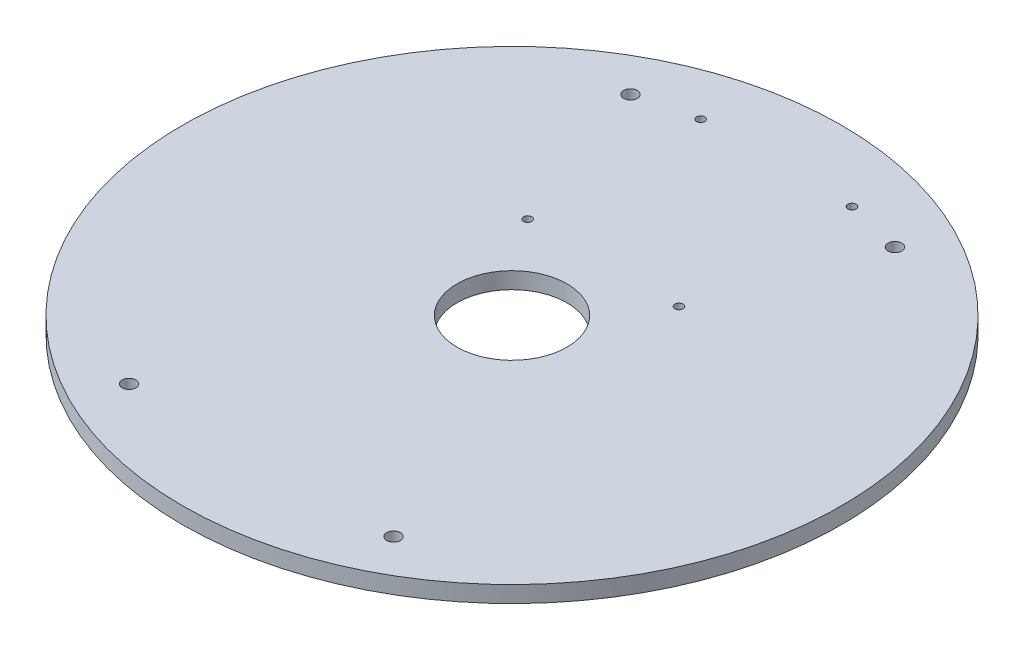
ISO-10303-21;
HEADER;
FILE_DESCRIPTION(('STEP AP214'),'2;1');
FILE_NAME('part.step','',(''),(''),'','','');
FILE_SCHEMA(('AUTOMOTIVE_DESIGN { 1 0 10303 214 1 1 1 1 }'));
ENDSEC;
DATA;
#1=APPLICATION_CONTEXT('core data for automotive mechanical design processes');
#2=APPLICATION_PROTOCOL_DEFINITION('international standard','automotive_design',2000,#1);
#3=PRODUCT_CONTEXT('',#1,'mechanical');
#4=PRODUCT('Part','Part','',(#3));
#5=PRODUCT_RELATED_PRODUCT_CATEGORY('part','',(#4));
#6=PRODUCT_DEFINITION_FORMATION('','',#4);
#7=PRODUCT_DEFINITION_CONTEXT('part definition',#1,'design');
#8=PRODUCT_DEFINITION('design','',#6,#7);
#9=PRODUCT_DEFINITION_SHAPE('','',#8);
#10=(LENGTH_UNIT() NAMED_UNIT(*) SI_UNIT(.MILLI.,.METRE.));
#11=(NAMED_UNIT(*) PLANE_ANGLE_UNIT() SI_UNIT($,.RADIAN.));
#12=(NAMED_UNIT(*) SI_UNIT($,.STERADIAN.) SOLID_ANGLE_UNIT());
#13=UNCERTAINTY_MEASURE_WITH_UNIT(LENGTH_MEASURE(1.E-05),#10,'distance_accuracy_value','');
#14=(GEOMETRIC_REPRESENTATION_CONTEXT(3) GLOBAL_UNCERTAINTY_ASSIGNED_CONTEXT((#13)) GLOBAL_UNIT_ASSIGNED_CONTEXT((#10,
#11,#12)) REPRESENTATION_CONTEXT('',''));
#15=CARTESIAN_POINT('',(0.,0.,0.));
#16=DIRECTION('',(0.,0.,1.));
#17=DIRECTION('',(1.,0.,0.));
#18=AXIS2_PLACEMENT_3D('',#15,#16,#17);
#19=CARTESIAN_POINT('',(0.,3.,0.));
#20=DIRECTION('',(0.,-1.,0.));
#21=DIRECTION('',(0.,0.,-1.));
#22=AXIS2_PLACEMENT_3D('',#19,#20,#21);
#23=CYLINDRICAL_SURFACE('',#22,60.);
#24=CARTESIAN_POINT('',(0.,3.,0.));
#25=DIRECTION('',(0.,1.,0.));
#26=DIRECTION('',(0.,0.,1.));
#27=AXIS2_PLACEMENT_3D('',#24,#25,#26);
#28=CIRCLE('',#27,60.);
#29=CARTESIAN_POINT('',(0.,3.,60.));
#30=VERTEX_POINT('',#29);
#31=EDGE_CURVE('E10',#30,#30,#28,.T.);
#32=ORIENTED_EDGE('',*,*,#31,.F.);
#33=EDGE_LOOP('',(#32));
#34=FACE_BOUND('',#33,.T.);
#35=CARTESIAN_POINT('',(0.,0.,0.));
#36=DIRECTION('',(0.,1.,0.));
#37=DIRECTION('',(0.,0.,1.));
#38=AXIS2_PLACEMENT_3D('',#35,#36,#37);
#39=CIRCLE('',#38,60.);
#40=CARTESIAN_POINT('',(0.,0.,60.));
#41=VERTEX_POINT('',#40);
#42=EDGE_CURVE('E34',#41,#41,#39,.T.);
#43=ORIENTED_EDGE('',*,*,#42,.T.);
#44=EDGE_LOOP('',(#43));
#45=FACE_BOUND('',#44,.T.);
#46=ADVANCED_FACE('F31',(#34,#45),#23,.T.);
#47=CARTESIAN_POINT('',(0.,3.,0.));
#48=DIRECTION('',(0.,1.,0.));
#49=DIRECTION('',(0.,0.,1.));
#50=AXIS2_PLACEMENT_3D('',#47,#48,#49);
#51=PLANE('',#50);
#52=CARTESIAN_POINT('',(-13.7737140560646,3.,-48.120776319641));
#53=DIRECTION('',(0.,1.,0.));
#54=DIRECTION('',(0.,0.,-1.));
#55=AXIS2_PLACEMENT_3D('',#52,#53,#54);
#56=CIRCLE('',#55,0.75);
#57=CARTESIAN_POINT('',(-13.7737140560646,3.,-48.870776319641));
#58=VERTEX_POINT('',#57);
#59=EDGE_CURVE('E79',#58,#58,#56,.T.);
#60=ORIENTED_EDGE('',*,*,#59,.F.);
#61=EDGE_LOOP('',(#60));
#62=FACE_BOUND('',#61,.T.);
#63=CARTESIAN_POINT('',(-13.7737140560646,3.,-16.620776319641));
#64=DIRECTION('',(0.,1.,0.));
#65=DIRECTION('',(0.,0.,1.));
#66=AXIS2_PLACEMENT_3D('',#63,#64,#65);
#67=CIRCLE('',#66,0.75);
#68=CARTESIAN_POINT('',(-13.7737140560646,3.,-15.870776319641));
#69=VERTEX_POINT('',#68);
#70=EDGE_CURVE('E85',#69,#69,#67,.T.);
#71=ORIENTED_EDGE('',*,*,#70,.F.);
#72=EDGE_LOOP('',(#71));
#73=FACE_BOUND('',#72,.T.);
#74=CARTESIAN_POINT('',(13.7737140560646,3.,-16.620776319641));
#75=DIRECTION('',(0.,1.,0.));
#76=DIRECTION('',(0.,0.,-1.));
#77=AXIS2_PLACEMENT_3D('',#74,#75,#76);
#78=CIRCLE('',#77,0.75);
#79=CARTESIAN_POINT('',(13.7737140560646,3.,-17.370776319641));
#80=VERTEX_POINT('',#79);
#81=EDGE_CURVE('E91',#80,#80,#78,.T.);
#82=ORIENTED_EDGE('',*,*,#81,.F.);
#83=EDGE_LOOP('',(#82));
#84=FACE_BOUND('',#83,.T.);
#85=CARTESIAN_POINT('',(13.7737140560646,3.,-48.120776319641));
#86=DIRECTION('',(0.,1.,0.));
#87=DIRECTION('',(0.,0.,1.));
#88=AXIS2_PLACEMENT_3D('',#85,#86,#87);
#89=CIRCLE('',#88,0.75);
#90=CARTESIAN_POINT('',(13.7737140560646,3.,-47.370776319641));
#91=VERTEX_POINT('',#90);
#92=EDGE_CURVE('E73',#91,#91,#89,.T.);
#93=ORIENTED_EDGE('',*,*,#92,.F.);
#94=EDGE_LOOP('',(#93));
#95=FACE_BOUND('',#94,.T.);
#96=CARTESIAN_POINT('',(0.,3.,0.));
#97=DIRECTION('',(0.,1.,0.));
#98=DIRECTION('',(0.,0.,1.));
#99=AXIS2_PLACEMENT_3D('',#96,#97,#98);
#100=CIRCLE('',#99,10.);
#101=CARTESIAN_POINT('',(0.,3.,10.));
#102=VERTEX_POINT('',#101);
#103=EDGE_CURVE('E67',#102,#102,#100,.T.);
#104=ORIENTED_EDGE('',*,*,#103,.F.);
#105=EDGE_LOOP('',(#104));
#106=FACE_BOUND('',#105,.T.);
#107=CARTESIAN_POINT('',(-24.0731025072115,3.,45.6446312019142));
#108=DIRECTION('',(0.,1.,0.));
#109=DIRECTION('',(0.,0.,-1.));
#110=AXIS2_PLACEMENT_3D('',#107,#108,#109);
#111=CIRCLE('',#110,1.25);
#112=CARTESIAN_POINT('',(-24.0731025072115,3.,44.3946312019142));
#113=VERTEX_POINT('',#112);
#114=EDGE_CURVE('E49',#113,#113,#111,.T.);
#115=ORIENTED_EDGE('',*,*,#114,.F.);
#116=EDGE_LOOP('',(#115));
#117=FACE_BOUND('',#116,.T.);
#118=CARTESIAN_POINT('',(24.0731025072115,3.,45.6446312019142));
#119=DIRECTION('',(0.,1.,0.));
#120=DIRECTION('',(0.,0.,1.));
#121=AXIS2_PLACEMENT_3D('',#118,#119,#120);
#122=CIRCLE('',#121,1.25);
#123=CARTESIAN_POINT('',(24.0731025072115,3.,46.8946312019142));
#124=VERTEX_POINT('',#123);
#125=EDGE_CURVE('E56',#124,#124,#122,.T.);
#126=ORIENTED_EDGE('',*,*,#125,.F.);
#127=EDGE_LOOP('',(#126));
#128=FACE_BOUND('',#127,.T.);
#129=CARTESIAN_POINT('',(24.0731025072115,3.,-45.6446312019142));
#130=DIRECTION('',(0.,1.,0.));
#131=DIRECTION('',(0.,0.,-1.));
#132=AXIS2_PLACEMENT_3D('',#129,#130,#131);
#133=CIRCLE('',#132,1.25);
#134=CARTESIAN_POINT('',(24.0731025072115,3.,-46.8946312019142));
#135=VERTEX_POINT('',#134);
#136=EDGE_CURVE('E62',#135,#135,#133,.T.);
#137=ORIENTED_EDGE('',*,*,#136,.F.);
#138=EDGE_LOOP('',(#137));
#139=FACE_BOUND('',#138,.T.);
#140=CARTESIAN_POINT('',(-24.0731025072115,3.,-45.6446312019142));
#141=DIRECTION('',(0.,1.,0.));
#142=DIRECTION('',(0.,0.,1.));
#143=AXIS2_PLACEMENT_3D('',#140,#141,#142);
#144=CIRCLE('',#143,1.25);
#145=CARTESIAN_POINT('',(-24.0731025072115,3.,-44.3946312019142));
#146=VERTEX_POINT('',#145);
#147=EDGE_CURVE('E43',#146,#146,#144,.T.);
#148=ORIENTED_EDGE('',*,*,#147,.F.);
#149=EDGE_LOOP('',(#148));
#150=FACE_BOUND('',#149,.T.);
#151=ORIENTED_EDGE('',*,*,#31,.T.);
#152=EDGE_LOOP('',(#151));
#153=FACE_BOUND('',#152,.T.);
#154=ADVANCED_FACE('F108',(#62,#73,#84,#95,#106,#117,#128,#139,#150,#153),#51,.T.);
#155=CARTESIAN_POINT('',(0.,0.,0.));
#156=DIRECTION('',(0.,1.,0.));
#157=DIRECTION('',(0.,0.,1.));
#158=AXIS2_PLACEMENT_3D('',#155,#156,#157);
#159=PLANE('',#158);
#160=CARTESIAN_POINT('',(-13.7737140560646,0.,-48.120776319641));
#161=DIRECTION('',(0.,1.,0.));
#162=DIRECTION('',(0.,0.,-1.));
#163=AXIS2_PLACEMENT_3D('',#160,#161,#162);
#164=CIRCLE('',#163,0.75);
#165=CARTESIAN_POINT('',(-13.7737140560646,0.,-48.870776319641));
#166=VERTEX_POINT('',#165);
#167=EDGE_CURVE('E82',#166,#166,#164,.T.);
#168=ORIENTED_EDGE('',*,*,#167,.T.);
#169=EDGE_LOOP('',(#168));
#170=FACE_BOUND('',#169,.T.);
#171=CARTESIAN_POINT('',(-13.7737140560646,0.,-16.620776319641));
#172=DIRECTION('',(0.,1.,0.));
#173=DIRECTION('',(0.,0.,1.));
#174=AXIS2_PLACEMENT_3D('',#171,#172,#173);
#175=CIRCLE('',#174,0.75);
#176=CARTESIAN_POINT('',(-13.7737140560646,0.,-15.870776319641));
#177=VERTEX_POINT('',#176);
#178=EDGE_CURVE('E88',#177,#177,#175,.T.);
#179=ORIENTED_EDGE('',*,*,#178,.T.);
#180=EDGE_LOOP('',(#179));
#181=FACE_BOUND('',#180,.T.);
#182=CARTESIAN_POINT('',(13.7737140560646,0.,-16.620776319641));
#183=DIRECTION('',(0.,1.,0.));
#184=DIRECTION('',(0.,0.,-1.));
#185=AXIS2_PLACEMENT_3D('',#182,#183,#184);
#186=CIRCLE('',#185,0.75);
#187=CARTESIAN_POINT('',(13.7737140560646,0.,-17.370776319641));
#188=VERTEX_POINT('',#187);
#189=EDGE_CURVE('E76',#188,#188,#186,.T.);
#190=ORIENTED_EDGE('',*,*,#189,.T.);
#191=EDGE_LOOP('',(#190));
#192=FACE_BOUND('',#191,.T.);
#193=CARTESIAN_POINT('',(13.7737140560646,0.,-48.120776319641));
#194=DIRECTION('',(0.,1.,0.));
#195=DIRECTION('',(0.,0.,1.));
#196=AXIS2_PLACEMENT_3D('',#193,#194,#195);
#197=CIRCLE('',#196,0.75);
#198=CARTESIAN_POINT('',(13.7737140560646,0.,-47.370776319641));
#199=VERTEX_POINT('',#198);
#200=EDGE_CURVE('E70',#199,#199,#197,.T.);
#201=ORIENTED_EDGE('',*,*,#200,.T.);
#202=EDGE_LOOP('',(#201));
#203=FACE_BOUND('',#202,.T.);
#204=CARTESIAN_POINT('',(0.,0.,0.));
#205=DIRECTION('',(0.,1.,0.));
#206=DIRECTION('',(0.,0.,1.));
#207=AXIS2_PLACEMENT_3D('',#204,#205,#206);
#208=CIRCLE('',#207,10.);
#209=CARTESIAN_POINT('',(0.,0.,10.));
#210=VERTEX_POINT('',#209);
#211=EDGE_CURVE('E53',#210,#210,#208,.T.);
#212=ORIENTED_EDGE('',*,*,#211,.T.);
#213=EDGE_LOOP('',(#212));
#214=FACE_BOUND('',#213,.T.);
#215=CARTESIAN_POINT('',(-24.0731025072115,0.,45.6446312019142));
#216=DIRECTION('',(0.,1.,0.));
#217=DIRECTION('',(0.,0.,-1.));
#218=AXIS2_PLACEMENT_3D('',#215,#216,#217);
#219=CIRCLE('',#218,1.25);
#220=CARTESIAN_POINT('',(-24.0731025072115,0.,44.3946312019142));
#221=VERTEX_POINT('',#220);
#222=EDGE_CURVE('E52',#221,#221,#219,.T.);
#223=ORIENTED_EDGE('',*,*,#222,.T.);
#224=EDGE_LOOP('',(#223));
#225=FACE_BOUND('',#224,.T.);
#226=CARTESIAN_POINT('',(24.0731025072115,0.,45.6446312019142));
#227=DIRECTION('',(0.,1.,0.));
#228=DIRECTION('',(0.,0.,1.));
#229=AXIS2_PLACEMENT_3D('',#226,#227,#228);
#230=CIRCLE('',#229,1.25);
#231=CARTESIAN_POINT('',(24.0731025072115,0.,46.8946312019142));
#232=VERTEX_POINT('',#231);
#233=EDGE_CURVE('E59',#232,#232,#230,.T.);
#234=ORIENTED_EDGE('',*,*,#233,.T.);
#235=EDGE_LOOP('',(#234));
#236=FACE_BOUND('',#235,.T.);
#237=CARTESIAN_POINT('',(24.0731025072115,0.,-45.6446312019142));
#238=DIRECTION('',(0.,1.,0.));
#239=DIRECTION('',(0.,0.,-1.));
#240=AXIS2_PLACEMENT_3D('',#237,#238,#239);
#241=CIRCLE('',#240,1.25);
#242=CARTESIAN_POINT('',(24.0731025072115,0.,-46.8946312019142));
#243=VERTEX_POINT('',#242);
#244=EDGE_CURVE('E46',#243,#243,#241,.T.);
#245=ORIENTED_EDGE('',*,*,#244,.T.);
#246=EDGE_LOOP('',(#245));
#247=FACE_BOUND('',#246,.T.);
#248=CARTESIAN_POINT('',(-24.0731025072115,0.,-45.6446312019142));
#249=DIRECTION('',(0.,1.,0.));
#250=DIRECTION('',(0.,0.,1.));
#251=AXIS2_PLACEMENT_3D('',#248,#249,#250);
#252=CIRCLE('',#251,1.25);
#253=CARTESIAN_POINT('',(-24.0731025072115,0.,-44.3946312019142));
#254=VERTEX_POINT('',#253);
#255=EDGE_CURVE('E41',#254,#254,#252,.T.);
#256=ORIENTED_EDGE('',*,*,#255,.T.);
#257=EDGE_LOOP('',(#256));
#258=FACE_BOUND('',#257,.T.);
#259=ORIENTED_EDGE('',*,*,#42,.F.);
#260=EDGE_LOOP('',(#259));
#261=FACE_BOUND('',#260,.T.);
#262=ADVANCED_FACE('F97',(#170,#181,#192,#203,#214,#225,#236,#247,#258,#261),#159,.F.);
#263=CARTESIAN_POINT('',(-24.0731025072115,0.,-45.6446312019142));
#264=DIRECTION('',(0.,1.,0.));
#265=DIRECTION('',(0.,0.,1.));
#266=AXIS2_PLACEMENT_3D('',#263,#264,#265);
#267=CYLINDRICAL_SURFACE('',#266,1.25);
#268=ORIENTED_EDGE('',*,*,#255,.F.);
#269=EDGE_LOOP('',(#268));
#270=FACE_BOUND('',#269,.T.);
#271=ORIENTED_EDGE('',*,*,#147,.T.);
#272=EDGE_LOOP('',(#271));
#273=FACE_BOUND('',#272,.T.);
#274=ADVANCED_FACE('F125',(#270,#273),#267,.F.);
#275=CARTESIAN_POINT('',(24.0731025072115,0.,-45.6446312019142));
#276=DIRECTION('',(0.,1.,0.));
#277=DIRECTION('',(0.,0.,1.));
#278=AXIS2_PLACEMENT_3D('',#275,#276,#277);
#279=CYLINDRICAL_SURFACE('',#278,1.25);
#280=ORIENTED_EDGE('',*,*,#244,.F.);
#281=EDGE_LOOP('',(#280));
#282=FACE_BOUND('',#281,.T.);
#283=ORIENTED_EDGE('',*,*,#136,.T.);
#284=EDGE_LOOP('',(#283));
#285=FACE_BOUND('',#284,.T.);
#286=ADVANCED_FACE('F127',(#282,#285),#279,.F.);
#287=CARTESIAN_POINT('',(24.0731025072115,0.,45.6446312019142));
#288=DIRECTION('',(0.,1.,0.));
#289=DIRECTION('',(0.,0.,1.));
#290=AXIS2_PLACEMENT_3D('',#287,#288,#289);
#291=CYLINDRICAL_SURFACE('',#290,1.25);
#292=ORIENTED_EDGE('',*,*,#233,.F.);
#293=EDGE_LOOP('',(#292));
#294=FACE_BOUND('',#293,.T.);
#295=ORIENTED_EDGE('',*,*,#125,.T.);
#296=EDGE_LOOP('',(#295));
#297=FACE_BOUND('',#296,.T.);
#298=ADVANCED_FACE('F134',(#294,#297),#291,.F.);
#299=CARTESIAN_POINT('',(-24.0731025072115,0.,45.6446312019142));
#300=DIRECTION('',(0.,1.,0.));
#301=DIRECTION('',(0.,0.,1.));
#302=AXIS2_PLACEMENT_3D('',#299,#300,#301);
#303=CYLINDRICAL_SURFACE('',#302,1.25);
#304=ORIENTED_EDGE('',*,*,#222,.F.);
#305=EDGE_LOOP('',(#304));
#306=FACE_BOUND('',#305,.T.);
#307=ORIENTED_EDGE('',*,*,#114,.T.);
#308=EDGE_LOOP('',(#307));
#309=FACE_BOUND('',#308,.T.);
#310=ADVANCED_FACE('F201',(#306,#309),#303,.F.);
#311=CARTESIAN_POINT('',(0.,0.,0.));
#312=DIRECTION('',(0.,1.,0.));
#313=DIRECTION('',(0.,0.,1.));
#314=AXIS2_PLACEMENT_3D('',#311,#312,#313);
#315=CYLINDRICAL_SURFACE('',#314,10.);
#316=ORIENTED_EDGE('',*,*,#211,.F.);
#317=EDGE_LOOP('',(#316));
#318=FACE_BOUND('',#317,.T.);
#319=ORIENTED_EDGE('',*,*,#103,.T.);
#320=EDGE_LOOP('',(#319));
#321=FACE_BOUND('',#320,.T.);
#322=ADVANCED_FACE('F166',(#318,#321),#315,.F.);
#323=CARTESIAN_POINT('',(13.7737140560646,0.,-48.120776319641));
#324=DIRECTION('',(0.,1.,0.));
#325=DIRECTION('',(0.,0.,1.));
#326=AXIS2_PLACEMENT_3D('',#323,#324,#325);
#327=CYLINDRICAL_SURFACE('',#326,0.75);
#328=ORIENTED_EDGE('',*,*,#200,.F.);
#329=EDGE_LOOP('',(#328));
#330=FACE_BOUND('',#329,.T.);
#331=ORIENTED_EDGE('',*,*,#92,.T.);
#332=EDGE_LOOP('',(#331));
#333=FACE_BOUND('',#332,.T.);
#334=ADVANCED_FACE('F104',(#330,#333),#327,.F.);
#335=CARTESIAN_POINT('',(13.7737140560646,0.,-16.620776319641));
#336=DIRECTION('',(0.,1.,0.));
#337=DIRECTION('',(0.,0.,1.));
#338=AXIS2_PLACEMENT_3D('',#335,#336,#337);
#339=CYLINDRICAL_SURFACE('',#338,0.75);
#340=ORIENTED_EDGE('',*,*,#189,.F.);
#341=EDGE_LOOP('',(#340));
#342=FACE_BOUND('',#341,.T.);
#343=ORIENTED_EDGE('',*,*,#81,.T.);
#344=EDGE_LOOP('',(#343));
#345=FACE_BOUND('',#344,.T.);
#346=ADVANCED_FACE('F100',(#342,#345),#339,.F.);
#347=CARTESIAN_POINT('',(-13.7737140560646,0.,-16.620776319641));
#348=DIRECTION('',(0.,1.,0.));
#349=DIRECTION('',(0.,0.,1.));
#350=AXIS2_PLACEMENT_3D('',#347,#348,#349);
#351=CYLINDRICAL_SURFACE('',#350,0.75);
#352=ORIENTED_EDGE('',*,*,#178,.F.);
#353=EDGE_LOOP('',(#352));
#354=FACE_BOUND('',#353,.T.);
#355=ORIENTED_EDGE('',*,*,#70,.T.);
#356=EDGE_LOOP('',(#355));
#357=FACE_BOUND('',#356,.T.);
#358=ADVANCED_FACE('F103',(#354,#357),#351,.F.);
#359=CARTESIAN_POINT('',(-13.7737140560646,0.,-48.120776319641));
#360=DIRECTION('',(0.,1.,0.));
#361=DIRECTION('',(0.,0.,1.));
#362=AXIS2_PLACEMENT_3D('',#359,#360,#361);
#363=CYLINDRICAL_SURFACE('',#362,0.75);
#364=ORIENTED_EDGE('',*,*,#167,.F.);
#365=EDGE_LOOP('',(#364));
#366=FACE_BOUND('',#365,.T.);
#367=ORIENTED_EDGE('',*,*,#59,.T.);
#368=EDGE_LOOP('',(#367));
#369=FACE_BOUND('',#368,.T.);
#370=ADVANCED_FACE('F184',(#366,#369),#363,.F.);
#371=CLOSED_SHELL('',(#46,#154,#262,#274,#286,#298,#310,#322,#334,#346,#358,#370));
#372=MANIFOLD_SOLID_BREP('B2',#371);
#373=ADVANCED_BREP_SHAPE_REPRESENTATION('',(#18,#372),#14);
#374=SHAPE_DEFINITION_REPRESENTATION(#9,#373);
ENDSEC;
END-ISO-10303-21;
